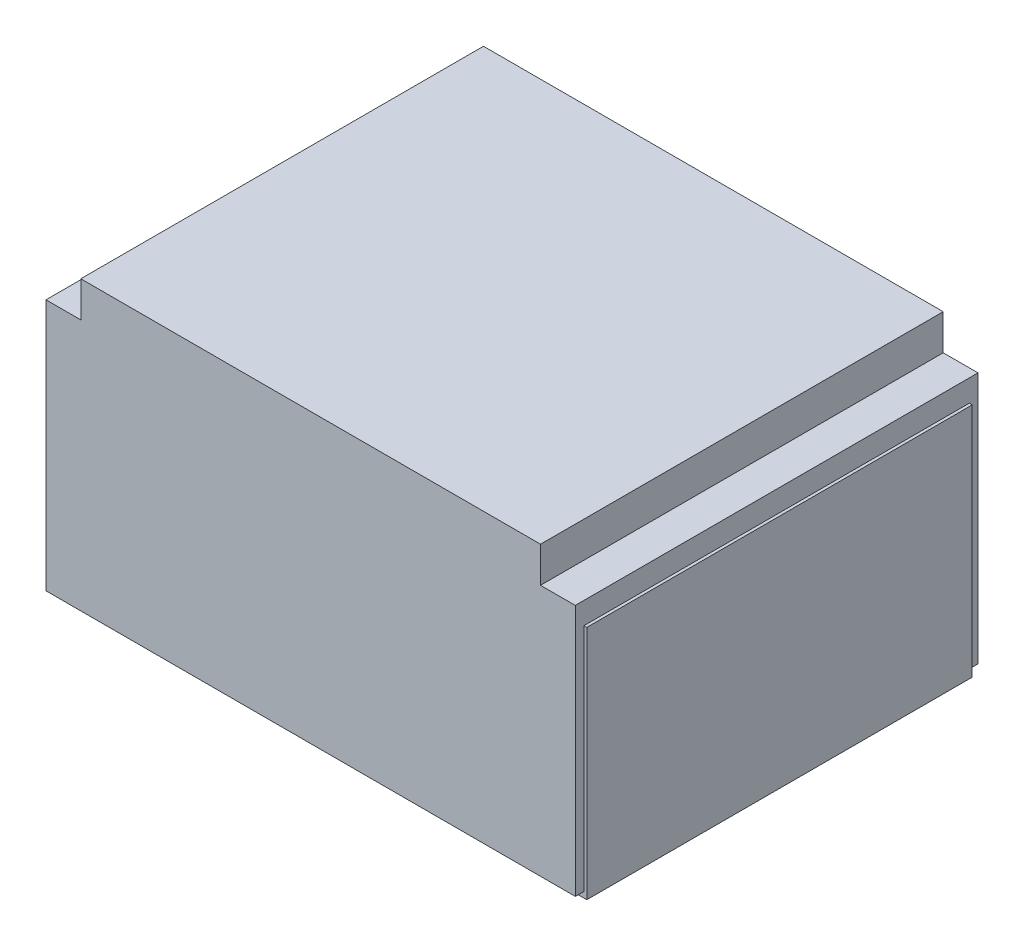
ISO-10303-21;
HEADER;
FILE_DESCRIPTION(('STEP AP214'),'2;1');
FILE_NAME('part.step','',(''),(''),'','','');
FILE_SCHEMA(('AUTOMOTIVE_DESIGN { 1 0 10303 214 1 1 1 1 }'));
ENDSEC;
DATA;
#1=APPLICATION_CONTEXT('core data for automotive mechanical design processes');
#2=APPLICATION_PROTOCOL_DEFINITION('international standard','automotive_design',2000,#1);
#3=PRODUCT_CONTEXT('',#1,'mechanical');
#4=PRODUCT('Part','Part','',(#3));
#5=PRODUCT_RELATED_PRODUCT_CATEGORY('part','',(#4));
#6=PRODUCT_DEFINITION_FORMATION('','',#4);
#7=PRODUCT_DEFINITION_CONTEXT('part definition',#1,'design');
#8=PRODUCT_DEFINITION('design','',#6,#7);
#9=PRODUCT_DEFINITION_SHAPE('','',#8);
#10=(LENGTH_UNIT() NAMED_UNIT(*) SI_UNIT(.MILLI.,.METRE.));
#11=(NAMED_UNIT(*) PLANE_ANGLE_UNIT() SI_UNIT($,.RADIAN.));
#12=(NAMED_UNIT(*) SI_UNIT($,.STERADIAN.) SOLID_ANGLE_UNIT());
#13=UNCERTAINTY_MEASURE_WITH_UNIT(LENGTH_MEASURE(1.E-05),#10,'distance_accuracy_value','');
#14=(GEOMETRIC_REPRESENTATION_CONTEXT(3) GLOBAL_UNCERTAINTY_ASSIGNED_CONTEXT((#13)) GLOBAL_UNIT_ASSIGNED_CONTEXT((#10,
#11,#12)) REPRESENTATION_CONTEXT('',''));
#15=CARTESIAN_POINT('',(0.,0.,0.));
#16=DIRECTION('',(0.,0.,1.));
#17=DIRECTION('',(1.,0.,0.));
#18=AXIS2_PLACEMENT_3D('',#15,#16,#17);
#19=CARTESIAN_POINT('',(0.,-1.65,1.59590093004976));
#20=DIRECTION('',(0.,1.,0.));
#21=DIRECTION('',(-1.,0.,0.));
#22=AXIS2_PLACEMENT_3D('',#19,#20,#21);
#23=CYLINDRICAL_SURFACE('',#22,1.);
#24=CARTESIAN_POINT('',(0.,-1.6,1.59590093004976));
#25=DIRECTION('',(0.,-1.,0.));
#26=DIRECTION('',(1.,0.,0.));
#27=AXIS2_PLACEMENT_3D('',#24,#25,#26);
#28=CIRCLE('',#27,1.);
#29=CARTESIAN_POINT('',(1.,-1.6,1.59590093004976));
#30=VERTEX_POINT('',#29);
#31=EDGE_CURVE('E11',#30,#30,#28,.F.);
#32=ORIENTED_EDGE('',*,*,#31,.T.);
#33=EDGE_LOOP('',(#32));
#34=FACE_BOUND('',#33,.T.);
#35=CARTESIAN_POINT('',(0.,-1.25,1.59590093004976));
#36=DIRECTION('',(0.,-1.,0.));
#37=DIRECTION('',(1.,0.,0.));
#38=AXIS2_PLACEMENT_3D('',#35,#36,#37);
#39=CIRCLE('',#38,1.);
#40=CARTESIAN_POINT('',(1.,-1.25,1.59590093004976));
#41=VERTEX_POINT('',#40);
#42=EDGE_CURVE('E63',#41,#41,#39,.T.);
#43=ORIENTED_EDGE('',*,*,#42,.T.);
#44=EDGE_LOOP('',(#43));
#45=FACE_BOUND('',#44,.T.);
#46=ADVANCED_FACE('F52',(#34,#45),#23,.T.);
#47=CARTESIAN_POINT('',(0.,-1.65,1.59590093004976));
#48=DIRECTION('',(0.,-1.,0.));
#49=DIRECTION('',(1.,0.,0.));
#50=AXIS2_PLACEMENT_3D('',#47,#48,#49);
#51=PLANE('',#50);
#52=CARTESIAN_POINT('',(0.,-1.65,1.59590093004976));
#53=DIRECTION('',(0.,-1.,0.));
#54=DIRECTION('',(1.,0.,0.));
#55=AXIS2_PLACEMENT_3D('',#52,#53,#54);
#56=CIRCLE('',#55,0.95);
#57=CARTESIAN_POINT('',(0.950000000000001,-1.65,1.59590093004976));
#58=VERTEX_POINT('',#57);
#59=EDGE_CURVE('E59',#58,#58,#56,.T.);
#60=ORIENTED_EDGE('',*,*,#59,.T.);
#61=EDGE_LOOP('',(#60));
#62=FACE_BOUND('',#61,.T.);
#63=ADVANCED_FACE('F73',(#62),#51,.T.);
#64=CARTESIAN_POINT('',(0.,-1.25,1.59590093004976));
#65=DIRECTION('',(0.,-1.,0.));
#66=DIRECTION('',(1.,0.,0.));
#67=AXIS2_PLACEMENT_3D('',#64,#65,#66);
#68=PLANE('',#67);
#69=ORIENTED_EDGE('',*,*,#42,.F.);
#70=EDGE_LOOP('',(#69));
#71=FACE_BOUND('',#70,.T.);
#72=ADVANCED_FACE('F71',(#71),#68,.F.);
#73=CARTESIAN_POINT('',(0.,-1.6,1.59590093004976));
#74=DIRECTION('',(0.,-1.,0.));
#75=DIRECTION('',(1.,0.,0.));
#76=AXIS2_PLACEMENT_3D('',#73,#74,#75);
#77=TOROIDAL_SURFACE('',#76,0.95,0.05);
#78=ORIENTED_EDGE('',*,*,#31,.F.);
#79=EDGE_LOOP('',(#78));
#80=FACE_BOUND('',#79,.T.);
#81=ORIENTED_EDGE('',*,*,#59,.F.);
#82=EDGE_LOOP('',(#81));
#83=FACE_BOUND('',#82,.T.);
#84=ADVANCED_FACE('F54',(#80,#83),#77,.T.);
#85=CLOSED_SHELL('',(#46,#63,#72,#84));
#86=MANIFOLD_SOLID_BREP('B2',#85);
#87=CARTESIAN_POINT('',(0.,-1.25,0.));
#88=DIRECTION('',(0.,1.,0.));
#89=DIRECTION('',(-1.,0.,0.));
#90=AXIS2_PLACEMENT_3D('',#87,#88,#89);
#91=PLANE('',#90);
#92=CARTESIAN_POINT('',(-1.92312305951284,-1.25,3.08939493928833));
#93=DIRECTION('',(0.,-1.,0.));
#94=DIRECTION('',(1.,0.,0.));
#95=AXIS2_PLACEMENT_3D('',#92,#93,#94);
#96=CIRCLE('',#95,0.162382368531784);
#97=CARTESIAN_POINT('',(-1.76074069098106,-1.25,3.08939493928833));
#98=VERTEX_POINT('',#97);
#99=EDGE_CURVE('E257',#98,#98,#96,.T.);
#100=ORIENTED_EDGE('',*,*,#99,.T.);
#101=EDGE_LOOP('',(#100));
#102=FACE_BOUND('',#101,.T.);
#103=CARTESIAN_POINT('',(0.,-1.25,1.59590093004976));
#104=DIRECTION('',(0.,-1.,0.));
#105=DIRECTION('',(1.,0.,0.));
#106=AXIS2_PLACEMENT_3D('',#103,#104,#105);
#107=CIRCLE('',#106,1.05);
#108=CARTESIAN_POINT('',(1.05,-1.25,1.59590093004976));
#109=VERTEX_POINT('',#108);
#110=EDGE_CURVE('E297',#109,#109,#107,.T.);
#111=ORIENTED_EDGE('',*,*,#110,.T.);
#112=EDGE_LOOP('',(#111));
#113=FACE_BOUND('',#112,.T.);
#114=CARTESIAN_POINT('',(1.92312305951285,-1.25,3.08939493928832));
#115=DIRECTION('',(0.,-1.,0.));
#116=DIRECTION('',(-1.,0.,0.));
#117=AXIS2_PLACEMENT_3D('',#114,#115,#116);
#118=CIRCLE('',#117,0.162382368531784);
#119=CARTESIAN_POINT('',(1.76074069098106,-1.25,3.08939493928832));
#120=VERTEX_POINT('',#119);
#121=EDGE_CURVE('E312',#120,#120,#118,.T.);
#122=ORIENTED_EDGE('',*,*,#121,.T.);
#123=EDGE_LOOP('',(#122));
#124=FACE_BOUND('',#123,.T.);
#125=DIRECTION('',(-1.,0.,0.));
#126=VECTOR('',#125,1.);
#127=CARTESIAN_POINT('',(-2.325,-1.25,3.425));
#128=LINE('',#127,#126);
#129=CARTESIAN_POINT('',(2.3,-1.25,3.425));
#130=VERTEX_POINT('',#129);
#131=CARTESIAN_POINT('',(-2.3,-1.25,3.425));
#132=VERTEX_POINT('',#131);
#133=EDGE_CURVE('E132',#130,#132,#128,.T.);
#134=ORIENTED_EDGE('',*,*,#133,.F.);
#135=DIRECTION('',(0.,0.,1.));
#136=VECTOR('',#135,1.);
#137=CARTESIAN_POINT('',(2.3,-1.25,3.425));
#138=LINE('',#137,#136);
#139=CARTESIAN_POINT('',(2.3,-1.25,0.0750000000000017));
#140=VERTEX_POINT('',#139);
#141=EDGE_CURVE('E235',#140,#130,#138,.T.);
#142=ORIENTED_EDGE('',*,*,#141,.F.);
#143=DIRECTION('',(1.,0.,0.));
#144=VECTOR('',#143,1.);
#145=CARTESIAN_POINT('',(-2.325,-1.25,0.075));
#146=LINE('',#145,#144);
#147=CARTESIAN_POINT('',(1.74824973955554,-1.25,0.0750000000000008));
#148=VERTEX_POINT('',#147);
#149=EDGE_CURVE('E247',#148,#140,#146,.T.);
#150=ORIENTED_EDGE('',*,*,#149,.F.);
#151=DIRECTION('',(0.,0.,1.));
#152=VECTOR('',#151,1.);
#153=CARTESIAN_POINT('',(1.74824973955554,-1.25,0.0750000000000008));
#154=LINE('',#153,#152);
#155=CARTESIAN_POINT('',(1.74824973955554,-1.25,0.44131323707769));
#156=VERTEX_POINT('',#155);
#157=EDGE_CURVE('E335',#148,#156,#154,.T.);
#158=ORIENTED_EDGE('',*,*,#157,.T.);
#159=DIRECTION('',(-1.,0.,0.));
#160=VECTOR('',#159,1.);
#161=CARTESIAN_POINT('',(1.74824973955554,-1.25,0.44131323707769));
#162=LINE('',#161,#160);
#163=CARTESIAN_POINT('',(1.64832212815136,-1.25,0.44131323707769));
#164=VERTEX_POINT('',#163);
#165=EDGE_CURVE('E140',#156,#164,#162,.T.);
#166=ORIENTED_EDGE('',*,*,#165,.T.);
#167=DIRECTION('',(-0.57346234436333,0.,-0.81923192051904));
#168=VECTOR('',#167,1.);
#169=CARTESIAN_POINT('',(1.64832212815136,-1.25,0.44131323707769));
#170=LINE('',#169,#168);
#171=CARTESIAN_POINT('',(1.47344880819406,-1.25,0.191494208567253));
#172=VERTEX_POINT('',#171);
#173=EDGE_CURVE('E363',#164,#172,#170,.T.);
#174=ORIENTED_EDGE('',*,*,#173,.T.);
#175=DIRECTION('',(-1.,0.,0.));
#176=VECTOR('',#175,1.);
#177=CARTESIAN_POINT('',(-1.47344880819406,-1.25,0.191494208567252));
#178=LINE('',#177,#176);
#179=CARTESIAN_POINT('',(-1.47344880819406,-1.25,0.191494208567252));
#180=VERTEX_POINT('',#179);
#181=EDGE_CURVE('E360',#172,#180,#178,.T.);
#182=ORIENTED_EDGE('',*,*,#181,.T.);
#183=DIRECTION('',(-0.573462344363329,0.,0.81923192051904));
#184=VECTOR('',#183,1.);
#185=CARTESIAN_POINT('',(-1.64832212815136,-1.25,0.441313237077689));
#186=LINE('',#185,#184);
#187=CARTESIAN_POINT('',(-1.64832212815136,-1.25,0.441313237077689));
#188=VERTEX_POINT('',#187);
#189=EDGE_CURVE('E357',#180,#188,#186,.T.);
#190=ORIENTED_EDGE('',*,*,#189,.T.);
#191=DIRECTION('',(-1.,0.,0.));
#192=VECTOR('',#191,1.);
#193=CARTESIAN_POINT('',(-1.74824973955554,-1.25,0.441313237077689));
#194=LINE('',#193,#192);
#195=CARTESIAN_POINT('',(-1.74824973955554,-1.25,0.441313237077689));
#196=VERTEX_POINT('',#195);
#197=EDGE_CURVE('E354',#188,#196,#194,.T.);
#198=ORIENTED_EDGE('',*,*,#197,.T.);
#199=DIRECTION('',(0.,0.,-1.));
#200=VECTOR('',#199,1.);
#201=CARTESIAN_POINT('',(-1.74824973955554,-1.25,0.075));
#202=LINE('',#201,#200);
#203=CARTESIAN_POINT('',(-1.74824973955554,-1.25,0.075));
#204=VERTEX_POINT('',#203);
#205=EDGE_CURVE('E317',#196,#204,#202,.T.);
#206=ORIENTED_EDGE('',*,*,#205,.T.);
#207=CARTESIAN_POINT('',(-2.3,-1.25,0.075));
#208=VERTEX_POINT('',#207);
#209=EDGE_CURVE('E254',#208,#204,#146,.T.);
#210=ORIENTED_EDGE('',*,*,#209,.F.);
#211=DIRECTION('',(0.,0.,-1.));
#212=VECTOR('',#211,1.);
#213=CARTESIAN_POINT('',(-2.3,-1.25,3.425));
#214=LINE('',#213,#212);
#215=EDGE_CURVE('E248',#132,#208,#214,.T.);
#216=ORIENTED_EDGE('',*,*,#215,.F.);
#217=EDGE_LOOP('',(#134,#142,#150,#158,#166,#174,#182,#190,#198,#206,#210,#216));
#218=FACE_BOUND('',#217,.T.);
#219=ADVANCED_FACE('F117',(#102,#113,#124,#218),#91,.T.);
#220=CARTESIAN_POINT('',(-2.325,-1.3,0.075));
#221=DIRECTION('',(0.,0.,1.));
#222=DIRECTION('',(1.,0.,0.));
#223=AXIS2_PLACEMENT_3D('',#220,#221,#222);
#224=PLANE('',#223);
#225=DIRECTION('',(0.,1.,0.));
#226=VECTOR('',#225,1.);
#227=CARTESIAN_POINT('',(-2.325,-1.3,0.075));
#228=LINE('',#227,#226);
#229=CARTESIAN_POINT('',(-2.325,-1.3,0.075));
#230=VERTEX_POINT('',#229);
#231=CARTESIAN_POINT('',(-2.325,0.75,0.075));
#232=VERTEX_POINT('',#231);
#233=EDGE_CURVE('E263',#230,#232,#228,.T.);
#234=ORIENTED_EDGE('',*,*,#233,.T.);
#235=DIRECTION('',(-1.,0.,0.));
#236=VECTOR('',#235,1.);
#237=CARTESIAN_POINT('',(-2.3,0.75,0.075));
#238=LINE('',#237,#236);
#239=CARTESIAN_POINT('',(-2.3,0.75,0.075));
#240=VERTEX_POINT('',#239);
#241=EDGE_CURVE('E280',#240,#232,#238,.T.);
#242=ORIENTED_EDGE('',*,*,#241,.F.);
#243=DIRECTION('',(0.,-1.,0.));
#244=VECTOR('',#243,1.);
#245=CARTESIAN_POINT('',(-2.3,0.75,0.075));
#246=LINE('',#245,#244);
#247=EDGE_CURVE('E288',#240,#208,#246,.T.);
#248=ORIENTED_EDGE('',*,*,#247,.T.);
#249=ORIENTED_EDGE('',*,*,#209,.T.);
#250=DIRECTION('',(0.,-1.,0.));
#251=VECTOR('',#250,1.);
#252=CARTESIAN_POINT('',(-1.74824973955554,-1.25,0.075));
#253=LINE('',#252,#251);
#254=CARTESIAN_POINT('',(-1.74824973955554,-1.3,0.075));
#255=VERTEX_POINT('',#254);
#256=EDGE_CURVE('E307',#204,#255,#253,.T.);
#257=ORIENTED_EDGE('',*,*,#256,.T.);
#258=DIRECTION('',(1.,0.,0.));
#259=VECTOR('',#258,1.);
#260=CARTESIAN_POINT('',(-2.325,-1.3,0.075));
#261=LINE('',#260,#259);
#262=EDGE_CURVE('E264',#230,#255,#261,.T.);
#263=ORIENTED_EDGE('',*,*,#262,.F.);
#264=EDGE_LOOP('',(#234,#242,#248,#249,#257,#263));
#265=FACE_BOUND('',#264,.T.);
#266=ADVANCED_FACE('F404',(#265),#224,.F.);
#267=CARTESIAN_POINT('',(2.325,-1.3,0.075));
#268=DIRECTION('',(-1.,0.,0.));
#269=DIRECTION('',(0.,-1.,0.));
#270=AXIS2_PLACEMENT_3D('',#267,#268,#269);
#271=PLANE('',#270);
#272=DIRECTION('',(0.,1.,0.));
#273=VECTOR('',#272,1.);
#274=CARTESIAN_POINT('',(2.325,-1.3,0.075));
#275=LINE('',#274,#273);
#276=CARTESIAN_POINT('',(2.325,-1.3,0.075));
#277=VERTEX_POINT('',#276);
#278=CARTESIAN_POINT('',(2.325,0.75,0.0750000000000017));
#279=VERTEX_POINT('',#278);
#280=EDGE_CURVE('E261',#277,#279,#275,.T.);
#281=ORIENTED_EDGE('',*,*,#280,.T.);
#282=DIRECTION('',(0.,0.,-1.));
#283=VECTOR('',#282,1.);
#284=CARTESIAN_POINT('',(2.325,0.75,0.0750000000000017));
#285=LINE('',#284,#283);
#286=CARTESIAN_POINT('',(2.325,0.75,3.425));
#287=VERTEX_POINT('',#286);
#288=EDGE_CURVE('E386',#287,#279,#285,.T.);
#289=ORIENTED_EDGE('',*,*,#288,.F.);
#290=DIRECTION('',(0.,1.,0.));
#291=VECTOR('',#290,1.);
#292=CARTESIAN_POINT('',(2.325,-1.3,3.425));
#293=LINE('',#292,#291);
#294=CARTESIAN_POINT('',(2.325,-1.3,3.425));
#295=VERTEX_POINT('',#294);
#296=EDGE_CURVE('E50',#295,#287,#293,.T.);
#297=ORIENTED_EDGE('',*,*,#296,.F.);
#298=DIRECTION('',(0.,0.,1.));
#299=VECTOR('',#298,1.);
#300=CARTESIAN_POINT('',(2.325,-1.3,0.075));
#301=LINE('',#300,#299);
#302=EDGE_CURVE('E256',#277,#295,#301,.T.);
#303=ORIENTED_EDGE('',*,*,#302,.F.);
#304=EDGE_LOOP('',(#281,#289,#297,#303));
#305=FACE_BOUND('',#304,.T.);
#306=ADVANCED_FACE('F119',(#305),#271,.F.);
#307=CARTESIAN_POINT('',(-2.325,-1.3,3.425));
#308=DIRECTION('',(0.,0.,-1.));
#309=DIRECTION('',(-1.,0.,0.));
#310=AXIS2_PLACEMENT_3D('',#307,#308,#309);
#311=PLANE('',#310);
#312=ORIENTED_EDGE('',*,*,#296,.T.);
#313=DIRECTION('',(1.,0.,0.));
#314=VECTOR('',#313,1.);
#315=CARTESIAN_POINT('',(2.325,0.75,3.425));
#316=LINE('',#315,#314);
#317=CARTESIAN_POINT('',(2.3,0.75,3.425));
#318=VERTEX_POINT('',#317);
#319=EDGE_CURVE('E388',#318,#287,#316,.T.);
#320=ORIENTED_EDGE('',*,*,#319,.F.);
#321=DIRECTION('',(0.,-1.,0.));
#322=VECTOR('',#321,1.);
#323=CARTESIAN_POINT('',(2.3,0.75,3.425));
#324=LINE('',#323,#322);
#325=EDGE_CURVE('E242',#318,#130,#324,.T.);
#326=ORIENTED_EDGE('',*,*,#325,.T.);
#327=ORIENTED_EDGE('',*,*,#133,.T.);
#328=DIRECTION('',(0.,-1.,0.));
#329=VECTOR('',#328,1.);
#330=CARTESIAN_POINT('',(-2.3,0.75,3.425));
#331=LINE('',#330,#329);
#332=CARTESIAN_POINT('',(-2.3,0.75,3.425));
#333=VERTEX_POINT('',#332);
#334=EDGE_CURVE('E284',#333,#132,#331,.T.);
#335=ORIENTED_EDGE('',*,*,#334,.F.);
#336=DIRECTION('',(1.,0.,0.));
#337=VECTOR('',#336,1.);
#338=CARTESIAN_POINT('',(-2.325,0.75,3.425));
#339=LINE('',#338,#337);
#340=CARTESIAN_POINT('',(-2.325,0.75,3.425));
#341=VERTEX_POINT('',#340);
#342=EDGE_CURVE('E278',#341,#333,#339,.T.);
#343=ORIENTED_EDGE('',*,*,#342,.F.);
#344=DIRECTION('',(0.,1.,0.));
#345=VECTOR('',#344,1.);
#346=CARTESIAN_POINT('',(-2.325,-1.3,3.425));
#347=LINE('',#346,#345);
#348=CARTESIAN_POINT('',(-2.325,-1.3,3.425));
#349=VERTEX_POINT('',#348);
#350=EDGE_CURVE('E125',#349,#341,#347,.T.);
#351=ORIENTED_EDGE('',*,*,#350,.F.);
#352=DIRECTION('',(-1.,0.,0.));
#353=VECTOR('',#352,1.);
#354=CARTESIAN_POINT('',(-2.325,-1.3,3.425));
#355=LINE('',#354,#353);
#356=EDGE_CURVE('E370',#295,#349,#355,.T.);
#357=ORIENTED_EDGE('',*,*,#356,.F.);
#358=EDGE_LOOP('',(#312,#320,#326,#327,#335,#343,#351,#357));
#359=FACE_BOUND('',#358,.T.);
#360=ADVANCED_FACE('F282',(#359),#311,.F.);
#361=CARTESIAN_POINT('',(-2.325,-1.3,0.075));
#362=DIRECTION('',(1.,0.,0.));
#363=DIRECTION('',(0.,1.,0.));
#364=AXIS2_PLACEMENT_3D('',#361,#362,#363);
#365=PLANE('',#364);
#366=ORIENTED_EDGE('',*,*,#350,.T.);
#367=DIRECTION('',(0.,0.,1.));
#368=VECTOR('',#367,1.);
#369=CARTESIAN_POINT('',(-2.325,0.75,0.075));
#370=LINE('',#369,#368);
#371=EDGE_CURVE('E272',#232,#341,#370,.T.);
#372=ORIENTED_EDGE('',*,*,#371,.F.);
#373=ORIENTED_EDGE('',*,*,#233,.F.);
#374=DIRECTION('',(0.,0.,-1.));
#375=VECTOR('',#374,1.);
#376=CARTESIAN_POINT('',(-2.325,-1.3,0.075));
#377=LINE('',#376,#375);
#378=EDGE_CURVE('E274',#349,#230,#377,.T.);
#379=ORIENTED_EDGE('',*,*,#378,.F.);
#380=EDGE_LOOP('',(#366,#372,#373,#379));
#381=FACE_BOUND('',#380,.T.);
#382=ADVANCED_FACE('F270',(#381),#365,.F.);
#383=CARTESIAN_POINT('',(1.74824973955554,-1.3,0.0750000000000008));
#384=VERTEX_POINT('',#383);
#385=EDGE_CURVE('E372',#384,#277,#261,.T.);
#386=ORIENTED_EDGE('',*,*,#385,.F.);
#387=DIRECTION('',(0.,-1.,0.));
#388=VECTOR('',#387,1.);
#389=CARTESIAN_POINT('',(1.74824973955554,-1.25,0.0750000000000008));
#390=LINE('',#389,#388);
#391=EDGE_CURVE('E253',#148,#384,#390,.T.);
#392=ORIENTED_EDGE('',*,*,#391,.F.);
#393=ORIENTED_EDGE('',*,*,#149,.T.);
#394=DIRECTION('',(0.,-1.,0.));
#395=VECTOR('',#394,1.);
#396=CARTESIAN_POINT('',(2.3,0.75,0.0750000000000017));
#397=LINE('',#396,#395);
#398=CARTESIAN_POINT('',(2.3,0.75,0.0750000000000017));
#399=VERTEX_POINT('',#398);
#400=EDGE_CURVE('E231',#399,#140,#397,.T.);
#401=ORIENTED_EDGE('',*,*,#400,.F.);
#402=DIRECTION('',(-1.,0.,0.));
#403=VECTOR('',#402,1.);
#404=CARTESIAN_POINT('',(2.3,0.75,0.0750000000000017));
#405=LINE('',#404,#403);
#406=EDGE_CURVE('E241',#279,#399,#405,.T.);
#407=ORIENTED_EDGE('',*,*,#406,.F.);
#408=ORIENTED_EDGE('',*,*,#280,.F.);
#409=EDGE_LOOP('',(#386,#392,#393,#401,#407,#408));
#410=FACE_BOUND('',#409,.T.);
#411=ADVANCED_FACE('F252',(#410),#224,.F.);
#412=CARTESIAN_POINT('',(0.,-1.3,0.));
#413=DIRECTION('',(0.,1.,0.));
#414=DIRECTION('',(-1.,0.,0.));
#415=AXIS2_PLACEMENT_3D('',#412,#413,#414);
#416=PLANE('',#415);
#417=CARTESIAN_POINT('',(-1.92312305951284,-1.3,3.08939493928833));
#418=DIRECTION('',(0.,-1.,0.));
#419=DIRECTION('',(1.,0.,0.));
#420=AXIS2_PLACEMENT_3D('',#417,#418,#419);
#421=CIRCLE('',#420,0.162382368531784);
#422=CARTESIAN_POINT('',(-1.76074069098106,-1.3,3.08939493928833));
#423=VERTEX_POINT('',#422);
#424=EDGE_CURVE('E300',#423,#423,#421,.T.);
#425=ORIENTED_EDGE('',*,*,#424,.F.);
#426=EDGE_LOOP('',(#425));
#427=FACE_BOUND('',#426,.T.);
#428=CARTESIAN_POINT('',(0.,-1.3,1.59590093004976));
#429=DIRECTION('',(0.,-1.,0.));
#430=DIRECTION('',(1.,0.,0.));
#431=AXIS2_PLACEMENT_3D('',#428,#429,#430);
#432=CIRCLE('',#431,1.05);
#433=CARTESIAN_POINT('',(1.05,-1.3,1.59590093004976));
#434=VERTEX_POINT('',#433);
#435=EDGE_CURVE('E304',#434,#434,#432,.T.);
#436=ORIENTED_EDGE('',*,*,#435,.F.);
#437=EDGE_LOOP('',(#436));
#438=FACE_BOUND('',#437,.T.);
#439=CARTESIAN_POINT('',(1.92312305951285,-1.3,3.08939493928832));
#440=DIRECTION('',(0.,-1.,0.));
#441=DIRECTION('',(-1.,0.,0.));
#442=AXIS2_PLACEMENT_3D('',#439,#440,#441);
#443=CIRCLE('',#442,0.162382368531784);
#444=CARTESIAN_POINT('',(1.76074069098106,-1.3,3.08939493928832));
#445=VERTEX_POINT('',#444);
#446=EDGE_CURVE('E303',#445,#445,#443,.T.);
#447=ORIENTED_EDGE('',*,*,#446,.F.);
#448=EDGE_LOOP('',(#447));
#449=FACE_BOUND('',#448,.T.);
#450=ORIENTED_EDGE('',*,*,#262,.T.);
#451=DIRECTION('',(0.,0.,-1.));
#452=VECTOR('',#451,1.);
#453=CARTESIAN_POINT('',(-1.74824973955554,-1.3,0.075));
#454=LINE('',#453,#452);
#455=CARTESIAN_POINT('',(-1.74824973955554,-1.3,0.441313237077689));
#456=VERTEX_POINT('',#455);
#457=EDGE_CURVE('E332',#456,#255,#454,.T.);
#458=ORIENTED_EDGE('',*,*,#457,.F.);
#459=DIRECTION('',(-1.,0.,0.));
#460=VECTOR('',#459,1.);
#461=CARTESIAN_POINT('',(-1.74824973955554,-1.3,0.441313237077689));
#462=LINE('',#461,#460);
#463=CARTESIAN_POINT('',(-1.64832212815136,-1.3,0.441313237077689));
#464=VERTEX_POINT('',#463);
#465=EDGE_CURVE('E334',#464,#456,#462,.T.);
#466=ORIENTED_EDGE('',*,*,#465,.F.);
#467=DIRECTION('',(-0.573462344363329,0.,0.81923192051904));
#468=VECTOR('',#467,1.);
#469=CARTESIAN_POINT('',(-1.64832212815136,-1.3,0.441313237077689));
#470=LINE('',#469,#468);
#471=CARTESIAN_POINT('',(-1.47344880819406,-1.3,0.191494208567252));
#472=VERTEX_POINT('',#471);
#473=EDGE_CURVE('E338',#472,#464,#470,.T.);
#474=ORIENTED_EDGE('',*,*,#473,.F.);
#475=DIRECTION('',(-1.,0.,0.));
#476=VECTOR('',#475,1.);
#477=CARTESIAN_POINT('',(-1.47344880819406,-1.3,0.191494208567252));
#478=LINE('',#477,#476);
#479=CARTESIAN_POINT('',(1.47344880819406,-1.3,0.191494208567253));
#480=VERTEX_POINT('',#479);
#481=EDGE_CURVE('E341',#480,#472,#478,.T.);
#482=ORIENTED_EDGE('',*,*,#481,.F.);
#483=DIRECTION('',(-0.57346234436333,0.,-0.81923192051904));
#484=VECTOR('',#483,1.);
#485=CARTESIAN_POINT('',(1.64832212815136,-1.3,0.44131323707769));
#486=LINE('',#485,#484);
#487=CARTESIAN_POINT('',(1.64832212815136,-1.3,0.44131323707769));
#488=VERTEX_POINT('',#487);
#489=EDGE_CURVE('E344',#488,#480,#486,.T.);
#490=ORIENTED_EDGE('',*,*,#489,.F.);
#491=DIRECTION('',(-1.,0.,0.));
#492=VECTOR('',#491,1.);
#493=CARTESIAN_POINT('',(1.74824973955554,-1.3,0.44131323707769));
#494=LINE('',#493,#492);
#495=CARTESIAN_POINT('',(1.74824973955554,-1.3,0.44131323707769));
#496=VERTEX_POINT('',#495);
#497=EDGE_CURVE('E347',#496,#488,#494,.T.);
#498=ORIENTED_EDGE('',*,*,#497,.F.);
#499=DIRECTION('',(0.,0.,1.));
#500=VECTOR('',#499,1.);
#501=CARTESIAN_POINT('',(1.74824973955554,-1.3,0.0750000000000008));
#502=LINE('',#501,#500);
#503=EDGE_CURVE('E315',#384,#496,#502,.T.);
#504=ORIENTED_EDGE('',*,*,#503,.F.);
#505=ORIENTED_EDGE('',*,*,#385,.T.);
#506=ORIENTED_EDGE('',*,*,#302,.T.);
#507=ORIENTED_EDGE('',*,*,#356,.T.);
#508=ORIENTED_EDGE('',*,*,#378,.T.);
#509=EDGE_LOOP('',(#450,#458,#466,#474,#482,#490,#498,#504,#505,#506,#507,#508));
#510=FACE_BOUND('',#509,.T.);
#511=ADVANCED_FACE('F379',(#427,#438,#449,#510),#416,.F.);
#512=CARTESIAN_POINT('',(1.92312305951285,-1.25,3.08939493928832));
#513=DIRECTION('',(0.,-1.,0.));
#514=DIRECTION('',(1.,0.,0.));
#515=AXIS2_PLACEMENT_3D('',#512,#513,#514);
#516=CYLINDRICAL_SURFACE('',#515,0.162382368531784);
#517=ORIENTED_EDGE('',*,*,#121,.F.);
#518=EDGE_LOOP('',(#517));
#519=FACE_BOUND('',#518,.T.);
#520=ORIENTED_EDGE('',*,*,#446,.T.);
#521=EDGE_LOOP('',(#520));
#522=FACE_BOUND('',#521,.T.);
#523=ADVANCED_FACE('F529',(#519,#522),#516,.F.);
#524=CARTESIAN_POINT('',(-1.74824973955554,-1.25,0.075));
#525=DIRECTION('',(-1.,0.,0.));
#526=DIRECTION('',(0.,-1.,0.));
#527=AXIS2_PLACEMENT_3D('',#524,#525,#526);
#528=PLANE('',#527);
#529=ORIENTED_EDGE('',*,*,#457,.T.);
#530=ORIENTED_EDGE('',*,*,#256,.F.);
#531=ORIENTED_EDGE('',*,*,#205,.F.);
#532=DIRECTION('',(0.,-1.,0.));
#533=VECTOR('',#532,1.);
#534=CARTESIAN_POINT('',(-1.74824973955554,-1.25,0.441313237077689));
#535=LINE('',#534,#533);
#536=EDGE_CURVE('E328',#196,#456,#535,.T.);
#537=ORIENTED_EDGE('',*,*,#536,.T.);
#538=EDGE_LOOP('',(#529,#530,#531,#537));
#539=FACE_BOUND('',#538,.T.);
#540=ADVANCED_FACE('F519',(#539),#528,.F.);
#541=CARTESIAN_POINT('',(-1.74824973955554,-1.25,0.441313237077689));
#542=DIRECTION('',(0.,0.,1.));
#543=DIRECTION('',(1.,0.,0.));
#544=AXIS2_PLACEMENT_3D('',#541,#542,#543);
#545=PLANE('',#544);
#546=ORIENTED_EDGE('',*,*,#465,.T.);
#547=ORIENTED_EDGE('',*,*,#536,.F.);
#548=ORIENTED_EDGE('',*,*,#197,.F.);
#549=DIRECTION('',(0.,-1.,0.));
#550=VECTOR('',#549,1.);
#551=CARTESIAN_POINT('',(-1.64832212815136,-1.25,0.441313237077689));
#552=LINE('',#551,#550);
#553=EDGE_CURVE('E326',#188,#464,#552,.T.);
#554=ORIENTED_EDGE('',*,*,#553,.T.);
#555=EDGE_LOOP('',(#546,#547,#548,#554));
#556=FACE_BOUND('',#555,.T.);
#557=ADVANCED_FACE('F509',(#556),#545,.F.);
#558=CARTESIAN_POINT('',(-1.64832212815136,-1.25,0.441313237077689));
#559=DIRECTION('',(0.81923192051904,0.,0.573462344363329));
#560=DIRECTION('',(0.573462344363329,0.,-0.81923192051904));
#561=AXIS2_PLACEMENT_3D('',#558,#559,#560);
#562=PLANE('',#561);
#563=ORIENTED_EDGE('',*,*,#473,.T.);
#564=ORIENTED_EDGE('',*,*,#553,.F.);
#565=ORIENTED_EDGE('',*,*,#189,.F.);
#566=DIRECTION('',(0.,-1.,0.));
#567=VECTOR('',#566,1.);
#568=CARTESIAN_POINT('',(-1.47344880819406,-1.25,0.191494208567252));
#569=LINE('',#568,#567);
#570=EDGE_CURVE('E324',#180,#472,#569,.T.);
#571=ORIENTED_EDGE('',*,*,#570,.T.);
#572=EDGE_LOOP('',(#563,#564,#565,#571));
#573=FACE_BOUND('',#572,.T.);
#574=ADVANCED_FACE('F499',(#573),#562,.F.);
#575=CARTESIAN_POINT('',(-1.47344880819406,-1.25,0.191494208567252));
#576=DIRECTION('',(0.,0.,1.));
#577=DIRECTION('',(1.,0.,0.));
#578=AXIS2_PLACEMENT_3D('',#575,#576,#577);
#579=PLANE('',#578);
#580=ORIENTED_EDGE('',*,*,#481,.T.);
#581=ORIENTED_EDGE('',*,*,#570,.F.);
#582=ORIENTED_EDGE('',*,*,#181,.F.);
#583=DIRECTION('',(0.,-1.,0.));
#584=VECTOR('',#583,1.);
#585=CARTESIAN_POINT('',(1.47344880819406,-1.25,0.191494208567253));
#586=LINE('',#585,#584);
#587=EDGE_CURVE('E322',#172,#480,#586,.T.);
#588=ORIENTED_EDGE('',*,*,#587,.T.);
#589=EDGE_LOOP('',(#580,#581,#582,#588));
#590=FACE_BOUND('',#589,.T.);
#591=ADVANCED_FACE('F489',(#590),#579,.F.);
#592=CARTESIAN_POINT('',(1.64832212815136,-1.25,0.44131323707769));
#593=DIRECTION('',(-0.81923192051904,0.,0.57346234436333));
#594=DIRECTION('',(0.57346234436333,0.,0.81923192051904));
#595=AXIS2_PLACEMENT_3D('',#592,#593,#594);
#596=PLANE('',#595);
#597=ORIENTED_EDGE('',*,*,#489,.T.);
#598=ORIENTED_EDGE('',*,*,#587,.F.);
#599=ORIENTED_EDGE('',*,*,#173,.F.);
#600=DIRECTION('',(0.,-1.,0.));
#601=VECTOR('',#600,1.);
#602=CARTESIAN_POINT('',(1.64832212815136,-1.25,0.44131323707769));
#603=LINE('',#602,#601);
#604=EDGE_CURVE('E320',#164,#488,#603,.T.);
#605=ORIENTED_EDGE('',*,*,#604,.T.);
#606=EDGE_LOOP('',(#597,#598,#599,#605));
#607=FACE_BOUND('',#606,.T.);
#608=ADVANCED_FACE('F480',(#607),#596,.F.);
#609=CARTESIAN_POINT('',(1.74824973955554,-1.25,0.44131323707769));
#610=DIRECTION('',(0.,0.,1.));
#611=DIRECTION('',(1.,0.,0.));
#612=AXIS2_PLACEMENT_3D('',#609,#610,#611);
#613=PLANE('',#612);
#614=ORIENTED_EDGE('',*,*,#497,.T.);
#615=ORIENTED_EDGE('',*,*,#604,.F.);
#616=ORIENTED_EDGE('',*,*,#165,.F.);
#617=DIRECTION('',(0.,-1.,0.));
#618=VECTOR('',#617,1.);
#619=CARTESIAN_POINT('',(1.74824973955554,-1.25,0.44131323707769));
#620=LINE('',#619,#618);
#621=EDGE_CURVE('E318',#156,#496,#620,.T.);
#622=ORIENTED_EDGE('',*,*,#621,.T.);
#623=EDGE_LOOP('',(#614,#615,#616,#622));
#624=FACE_BOUND('',#623,.T.);
#625=ADVANCED_FACE('F470',(#624),#613,.F.);
#626=CARTESIAN_POINT('',(1.74824973955554,-1.25,0.0750000000000008));
#627=DIRECTION('',(1.,0.,0.));
#628=DIRECTION('',(0.,0.,-1.));
#629=AXIS2_PLACEMENT_3D('',#626,#627,#628);
#630=PLANE('',#629);
#631=ORIENTED_EDGE('',*,*,#503,.T.);
#632=ORIENTED_EDGE('',*,*,#621,.F.);
#633=ORIENTED_EDGE('',*,*,#157,.F.);
#634=ORIENTED_EDGE('',*,*,#391,.T.);
#635=EDGE_LOOP('',(#631,#632,#633,#634));
#636=FACE_BOUND('',#635,.T.);
#637=ADVANCED_FACE('F460',(#636),#630,.F.);
#638=CARTESIAN_POINT('',(0.,-1.25,1.59590093004976));
#639=DIRECTION('',(0.,-1.,0.));
#640=DIRECTION('',(1.,0.,0.));
#641=AXIS2_PLACEMENT_3D('',#638,#639,#640);
#642=CYLINDRICAL_SURFACE('',#641,1.05);
#643=ORIENTED_EDGE('',*,*,#110,.F.);
#644=EDGE_LOOP('',(#643));
#645=FACE_BOUND('',#644,.T.);
#646=ORIENTED_EDGE('',*,*,#435,.T.);
#647=EDGE_LOOP('',(#646));
#648=FACE_BOUND('',#647,.T.);
#649=ADVANCED_FACE('F450',(#645,#648),#642,.F.);
#650=CARTESIAN_POINT('',(-1.92312305951284,-1.25,3.08939493928833));
#651=DIRECTION('',(0.,-1.,0.));
#652=DIRECTION('',(1.,0.,0.));
#653=AXIS2_PLACEMENT_3D('',#650,#651,#652);
#654=CYLINDRICAL_SURFACE('',#653,0.162382368531784);
#655=ORIENTED_EDGE('',*,*,#99,.F.);
#656=EDGE_LOOP('',(#655));
#657=FACE_BOUND('',#656,.T.);
#658=ORIENTED_EDGE('',*,*,#424,.T.);
#659=EDGE_LOOP('',(#658));
#660=FACE_BOUND('',#659,.T.);
#661=ADVANCED_FACE('F445',(#657,#660),#654,.F.);
#662=CARTESIAN_POINT('',(-2.3,0.75,3.425));
#663=DIRECTION('',(-1.,0.,0.));
#664=DIRECTION('',(0.,-1.,0.));
#665=AXIS2_PLACEMENT_3D('',#662,#663,#664);
#666=PLANE('',#665);
#667=ORIENTED_EDGE('',*,*,#215,.T.);
#668=ORIENTED_EDGE('',*,*,#247,.F.);
#669=DIRECTION('',(0.,0.,-1.));
#670=VECTOR('',#669,1.);
#671=CARTESIAN_POINT('',(-2.3,0.75,3.425));
#672=LINE('',#671,#670);
#673=EDGE_CURVE('E286',#333,#240,#672,.T.);
#674=ORIENTED_EDGE('',*,*,#673,.F.);
#675=ORIENTED_EDGE('',*,*,#334,.T.);
#676=EDGE_LOOP('',(#667,#668,#674,#675));
#677=FACE_BOUND('',#676,.T.);
#678=ADVANCED_FACE('F449',(#677),#666,.F.);
#679=CARTESIAN_POINT('',(0.,0.75,0.));
#680=DIRECTION('',(0.,1.,0.));
#681=DIRECTION('',(0.,0.,1.));
#682=AXIS2_PLACEMENT_3D('',#679,#680,#681);
#683=PLANE('',#682);
#684=ORIENTED_EDGE('',*,*,#241,.T.);
#685=ORIENTED_EDGE('',*,*,#371,.T.);
#686=ORIENTED_EDGE('',*,*,#342,.T.);
#687=ORIENTED_EDGE('',*,*,#673,.T.);
#688=EDGE_LOOP('',(#684,#685,#686,#687));
#689=FACE_BOUND('',#688,.T.);
#690=ADVANCED_FACE('F277',(#689),#683,.T.);
#691=CARTESIAN_POINT('',(2.3,0.75,3.425));
#692=DIRECTION('',(1.,0.,0.));
#693=DIRECTION('',(0.,1.,0.));
#694=AXIS2_PLACEMENT_3D('',#691,#692,#693);
#695=PLANE('',#694);
#696=ORIENTED_EDGE('',*,*,#141,.T.);
#697=ORIENTED_EDGE('',*,*,#325,.F.);
#698=DIRECTION('',(0.,0.,1.));
#699=VECTOR('',#698,1.);
#700=CARTESIAN_POINT('',(2.3,0.75,3.425));
#701=LINE('',#700,#699);
#702=EDGE_CURVE('E237',#399,#318,#701,.T.);
#703=ORIENTED_EDGE('',*,*,#702,.F.);
#704=ORIENTED_EDGE('',*,*,#400,.T.);
#705=EDGE_LOOP('',(#696,#697,#703,#704));
#706=FACE_BOUND('',#705,.T.);
#707=ADVANCED_FACE('F233',(#706),#695,.F.);
#708=CARTESIAN_POINT('',(0.,0.75,0.));
#709=DIRECTION('',(0.,-1.,0.));
#710=DIRECTION('',(0.,0.,-1.));
#711=AXIS2_PLACEMENT_3D('',#708,#709,#710);
#712=PLANE('',#711);
#713=ORIENTED_EDGE('',*,*,#702,.T.);
#714=ORIENTED_EDGE('',*,*,#319,.T.);
#715=ORIENTED_EDGE('',*,*,#288,.T.);
#716=ORIENTED_EDGE('',*,*,#406,.T.);
#717=EDGE_LOOP('',(#713,#714,#715,#716));
#718=FACE_BOUND('',#717,.T.);
#719=ADVANCED_FACE('F390',(#718),#712,.F.);
#720=CLOSED_SHELL('',(#219,#266,#306,#360,#382,#411,#511,#523,#540,#557,#574,#591,#608,#625,
#637,#649,#661,#678,#690,#707,#719));
#721=MANIFOLD_SOLID_BREP('B6',#720);
#722=CARTESIAN_POINT('',(-2.3,1.25,3.5));
#723=DIRECTION('',(1.,0.,0.));
#724=DIRECTION('',(0.,1.,0.));
#725=AXIS2_PLACEMENT_3D('',#722,#723,#724);
#726=PLANE('',#725);
#727=DIRECTION('',(0.,-1.,0.));
#728=VECTOR('',#727,1.);
#729=CARTESIAN_POINT('',(-2.3,1.25,3.5));
#730=LINE('',#729,#728);
#731=CARTESIAN_POINT('',(-2.3,0.940583691680877,3.5));
#732=VERTEX_POINT('',#731);
#733=CARTESIAN_POINT('',(-2.3,-1.25,3.5));
#734=VERTEX_POINT('',#733);
#735=EDGE_CURVE('E711',#732,#734,#730,.T.);
#736=ORIENTED_EDGE('',*,*,#735,.F.);
#737=DIRECTION('',(0.,0.,1.));
#738=VECTOR('',#737,1.);
#739=CARTESIAN_POINT('',(-2.3,0.940583691680877,0.));
#740=LINE('',#739,#738);
#741=CARTESIAN_POINT('',(-2.3,0.940583691680877,0.));
#742=VERTEX_POINT('',#741);
#743=EDGE_CURVE('E699',#742,#732,#740,.T.);
#744=ORIENTED_EDGE('',*,*,#743,.F.);
#745=DIRECTION('',(0.,-1.,0.));
#746=VECTOR('',#745,1.);
#747=CARTESIAN_POINT('',(-2.3,1.25,0.));
#748=LINE('',#747,#746);
#749=CARTESIAN_POINT('',(-2.3,-1.25,0.));
#750=VERTEX_POINT('',#749);
#751=EDGE_CURVE('E709',#742,#750,#748,.T.);
#752=ORIENTED_EDGE('',*,*,#751,.T.);
#753=DIRECTION('',(0.,0.,-1.));
#754=VECTOR('',#753,1.);
#755=CARTESIAN_POINT('',(-2.3,-1.25,3.5));
#756=LINE('',#755,#754);
#757=EDGE_CURVE('E115',#734,#750,#756,.T.);
#758=ORIENTED_EDGE('',*,*,#757,.F.);
#759=EDGE_LOOP('',(#736,#744,#752,#758));
#760=FACE_BOUND('',#759,.T.);
#761=ADVANCED_FACE('F631',(#760),#726,.F.);
#762=CARTESIAN_POINT('',(2.3,-1.25,3.5));
#763=DIRECTION('',(0.,1.,0.));
#764=DIRECTION('',(-1.,0.,0.));
#765=AXIS2_PLACEMENT_3D('',#762,#763,#764);
#766=PLANE('',#765);
#767=DIRECTION('',(1.,0.,0.));
#768=VECTOR('',#767,1.);
#769=CARTESIAN_POINT('',(2.3,-1.25,0.));
#770=LINE('',#769,#768);
#771=CARTESIAN_POINT('',(2.3,-1.25,0.));
#772=VERTEX_POINT('',#771);
#773=EDGE_CURVE('E715',#750,#772,#770,.T.);
#774=ORIENTED_EDGE('',*,*,#773,.T.);
#775=DIRECTION('',(0.,0.,-1.));
#776=VECTOR('',#775,1.);
#777=CARTESIAN_POINT('',(2.3,-1.25,3.5));
#778=LINE('',#777,#776);
#779=CARTESIAN_POINT('',(2.3,-1.25,3.5));
#780=VERTEX_POINT('',#779);
#781=EDGE_CURVE('E638',#780,#772,#778,.T.);
#782=ORIENTED_EDGE('',*,*,#781,.F.);
#783=DIRECTION('',(1.,0.,0.));
#784=VECTOR('',#783,1.);
#785=CARTESIAN_POINT('',(2.3,-1.25,3.5));
#786=LINE('',#785,#784);
#787=EDGE_CURVE('E741',#734,#780,#786,.T.);
#788=ORIENTED_EDGE('',*,*,#787,.F.);
#789=ORIENTED_EDGE('',*,*,#757,.T.);
#790=EDGE_LOOP('',(#774,#782,#788,#789));
#791=FACE_BOUND('',#790,.T.);
#792=ADVANCED_FACE('F775',(#791),#766,.F.);
#793=CARTESIAN_POINT('',(2.3,1.25,3.5));
#794=DIRECTION('',(-1.,0.,0.));
#795=DIRECTION('',(0.,-1.,0.));
#796=AXIS2_PLACEMENT_3D('',#793,#794,#795);
#797=PLANE('',#796);
#798=DIRECTION('',(0.,1.,0.));
#799=VECTOR('',#798,1.);
#800=CARTESIAN_POINT('',(2.3,1.25,0.));
#801=LINE('',#800,#799);
#802=CARTESIAN_POINT('',(2.3,0.940583691680892,0.));
#803=VERTEX_POINT('',#802);
#804=EDGE_CURVE('E718',#772,#803,#801,.T.);
#805=ORIENTED_EDGE('',*,*,#804,.T.);
#806=DIRECTION('',(0.,0.,1.));
#807=VECTOR('',#806,1.);
#808=CARTESIAN_POINT('',(2.3,0.940583691680877,0.));
#809=LINE('',#808,#807);
#810=CARTESIAN_POINT('',(2.3,0.940583691680877,3.5));
#811=VERTEX_POINT('',#810);
#812=EDGE_CURVE('E653',#803,#811,#809,.T.);
#813=ORIENTED_EDGE('',*,*,#812,.T.);
#814=DIRECTION('',(0.,1.,0.));
#815=VECTOR('',#814,1.);
#816=CARTESIAN_POINT('',(2.3,1.25,3.5));
#817=LINE('',#816,#815);
#818=EDGE_CURVE('E735',#780,#811,#817,.T.);
#819=ORIENTED_EDGE('',*,*,#818,.F.);
#820=ORIENTED_EDGE('',*,*,#781,.T.);
#821=EDGE_LOOP('',(#805,#813,#819,#820));
#822=FACE_BOUND('',#821,.T.);
#823=ADVANCED_FACE('F773',(#822),#797,.F.);
#824=CARTESIAN_POINT('',(2.3,1.25,3.5));
#825=DIRECTION('',(0.,-1.,0.));
#826=DIRECTION('',(1.,0.,0.));
#827=AXIS2_PLACEMENT_3D('',#824,#825,#826);
#828=PLANE('',#827);
#829=DIRECTION('',(-1.,0.,0.));
#830=VECTOR('',#829,1.);
#831=CARTESIAN_POINT('',(2.3,1.25,0.));
#832=LINE('',#831,#830);
#833=CARTESIAN_POINT('',(1.99779976113016,1.25,0.));
#834=VERTEX_POINT('',#833);
#835=CARTESIAN_POINT('',(-1.99779976113016,1.25,0.));
#836=VERTEX_POINT('',#835);
#837=EDGE_CURVE('E728',#834,#836,#832,.T.);
#838=ORIENTED_EDGE('',*,*,#837,.T.);
#839=DIRECTION('',(0.,0.,1.));
#840=VECTOR('',#839,1.);
#841=CARTESIAN_POINT('',(-1.99779976113016,1.25,0.));
#842=LINE('',#841,#840);
#843=CARTESIAN_POINT('',(-1.99779976113016,1.25,3.5));
#844=VERTEX_POINT('',#843);
#845=EDGE_CURVE('E716',#836,#844,#842,.T.);
#846=ORIENTED_EDGE('',*,*,#845,.T.);
#847=DIRECTION('',(-1.,0.,0.));
#848=VECTOR('',#847,1.);
#849=CARTESIAN_POINT('',(2.3,1.25,3.5));
#850=LINE('',#849,#848);
#851=CARTESIAN_POINT('',(1.99779976113016,1.25,3.5));
#852=VERTEX_POINT('',#851);
#853=EDGE_CURVE('E723',#852,#844,#850,.T.);
#854=ORIENTED_EDGE('',*,*,#853,.F.);
#855=DIRECTION('',(0.,0.,1.));
#856=VECTOR('',#855,1.);
#857=CARTESIAN_POINT('',(1.99779976113016,1.25,0.));
#858=LINE('',#857,#856);
#859=EDGE_CURVE('E758',#834,#852,#858,.T.);
#860=ORIENTED_EDGE('',*,*,#859,.F.);
#861=EDGE_LOOP('',(#838,#846,#854,#860));
#862=FACE_BOUND('',#861,.T.);
#863=ADVANCED_FACE('F768',(#862),#828,.F.);
#864=CARTESIAN_POINT('',(0.,0.,3.5));
#865=DIRECTION('',(0.,0.,-1.));
#866=DIRECTION('',(-1.,0.,0.));
#867=AXIS2_PLACEMENT_3D('',#864,#865,#866);
#868=PLANE('',#867);
#869=ORIENTED_EDGE('',*,*,#853,.T.);
#870=DIRECTION('',(0.,1.,0.));
#871=VECTOR('',#870,1.);
#872=CARTESIAN_POINT('',(-1.99779976113016,0.940583691680877,3.5));
#873=LINE('',#872,#871);
#874=CARTESIAN_POINT('',(-1.99779976113016,0.940583691680877,3.5));
#875=VERTEX_POINT('',#874);
#876=EDGE_CURVE('E704',#875,#844,#873,.T.);
#877=ORIENTED_EDGE('',*,*,#876,.F.);
#878=DIRECTION('',(1.,0.,0.));
#879=VECTOR('',#878,1.);
#880=CARTESIAN_POINT('',(-2.3,0.940583691680877,3.5));
#881=LINE('',#880,#879);
#882=EDGE_CURVE('E756',#732,#875,#881,.T.);
#883=ORIENTED_EDGE('',*,*,#882,.F.);
#884=ORIENTED_EDGE('',*,*,#735,.T.);
#885=ORIENTED_EDGE('',*,*,#787,.T.);
#886=ORIENTED_EDGE('',*,*,#818,.T.);
#887=DIRECTION('',(1.,0.,0.));
#888=VECTOR('',#887,1.);
#889=CARTESIAN_POINT('',(2.3,0.940583691680877,3.5));
#890=LINE('',#889,#888);
#891=CARTESIAN_POINT('',(1.99779976113017,0.940583691680907,3.5));
#892=VERTEX_POINT('',#891);
#893=EDGE_CURVE('E749',#892,#811,#890,.T.);
#894=ORIENTED_EDGE('',*,*,#893,.F.);
#895=DIRECTION('',(0.,-1.,0.));
#896=VECTOR('',#895,1.);
#897=CARTESIAN_POINT('',(1.99779976113017,0.940583691680907,3.5));
#898=LINE('',#897,#896);
#899=EDGE_CURVE('E753',#852,#892,#898,.T.);
#900=ORIENTED_EDGE('',*,*,#899,.F.);
#901=EDGE_LOOP('',(#869,#877,#883,#884,#885,#886,#894,#900));
#902=FACE_BOUND('',#901,.T.);
#903=ADVANCED_FACE('F771',(#902),#868,.F.);
#904=CARTESIAN_POINT('',(0.,0.,0.));
#905=DIRECTION('',(0.,0.,-1.));
#906=DIRECTION('',(-1.,0.,0.));
#907=AXIS2_PLACEMENT_3D('',#904,#905,#906);
#908=PLANE('',#907);
#909=DIRECTION('',(0.,1.,0.));
#910=VECTOR('',#909,1.);
#911=CARTESIAN_POINT('',(-1.99779976113016,0.940583691680877,0.));
#912=LINE('',#911,#910);
#913=CARTESIAN_POINT('',(-1.99779976113016,0.940583691680877,0.));
#914=VERTEX_POINT('',#913);
#915=EDGE_CURVE('E645',#914,#836,#912,.T.);
#916=ORIENTED_EDGE('',*,*,#915,.T.);
#917=ORIENTED_EDGE('',*,*,#837,.F.);
#918=DIRECTION('',(0.,-1.,0.));
#919=VECTOR('',#918,1.);
#920=CARTESIAN_POINT('',(1.99779976113017,0.940583691680907,0.));
#921=LINE('',#920,#919);
#922=CARTESIAN_POINT('',(1.99779976113017,0.940583691680907,0.));
#923=VERTEX_POINT('',#922);
#924=EDGE_CURVE('E746',#834,#923,#921,.T.);
#925=ORIENTED_EDGE('',*,*,#924,.T.);
#926=DIRECTION('',(1.,0.,0.));
#927=VECTOR('',#926,1.);
#928=CARTESIAN_POINT('',(2.3,0.940583691680877,0.));
#929=LINE('',#928,#927);
#930=EDGE_CURVE('E750',#923,#803,#929,.T.);
#931=ORIENTED_EDGE('',*,*,#930,.T.);
#932=ORIENTED_EDGE('',*,*,#804,.F.);
#933=ORIENTED_EDGE('',*,*,#773,.F.);
#934=ORIENTED_EDGE('',*,*,#751,.F.);
#935=DIRECTION('',(1.,0.,0.));
#936=VECTOR('',#935,1.);
#937=CARTESIAN_POINT('',(-2.3,0.940583691680877,0.));
#938=LINE('',#937,#936);
#939=EDGE_CURVE('E695',#742,#914,#938,.T.);
#940=ORIENTED_EDGE('',*,*,#939,.T.);
#941=EDGE_LOOP('',(#916,#917,#925,#931,#932,#933,#934,#940));
#942=FACE_BOUND('',#941,.T.);
#943=ADVANCED_FACE('F713',(#942),#908,.T.);
#944=CARTESIAN_POINT('',(1.99779976113017,0.940583691680907,0.));
#945=DIRECTION('',(-1.,0.,0.));
#946=DIRECTION('',(0.,-1.,0.));
#947=AXIS2_PLACEMENT_3D('',#944,#945,#946);
#948=PLANE('',#947);
#949=ORIENTED_EDGE('',*,*,#899,.T.);
#950=DIRECTION('',(0.,0.,1.));
#951=VECTOR('',#950,1.);
#952=CARTESIAN_POINT('',(1.99779976113017,0.940583691680907,0.));
#953=LINE('',#952,#951);
#954=EDGE_CURVE('E752',#923,#892,#953,.T.);
#955=ORIENTED_EDGE('',*,*,#954,.F.);
#956=ORIENTED_EDGE('',*,*,#924,.F.);
#957=ORIENTED_EDGE('',*,*,#859,.T.);
#958=EDGE_LOOP('',(#949,#955,#956,#957));
#959=FACE_BOUND('',#958,.T.);
#960=ADVANCED_FACE('F770',(#959),#948,.F.);
#961=CARTESIAN_POINT('',(2.3,0.940583691680877,0.));
#962=DIRECTION('',(0.,-1.,0.));
#963=DIRECTION('',(1.,0.,0.));
#964=AXIS2_PLACEMENT_3D('',#961,#962,#963);
#965=PLANE('',#964);
#966=ORIENTED_EDGE('',*,*,#893,.T.);
#967=ORIENTED_EDGE('',*,*,#812,.F.);
#968=ORIENTED_EDGE('',*,*,#930,.F.);
#969=ORIENTED_EDGE('',*,*,#954,.T.);
#970=EDGE_LOOP('',(#966,#967,#968,#969));
#971=FACE_BOUND('',#970,.T.);
#972=ADVANCED_FACE('F772',(#971),#965,.F.);
#973=CARTESIAN_POINT('',(-1.99779976113016,0.940583691680877,0.));
#974=DIRECTION('',(1.,0.,0.));
#975=DIRECTION('',(0.,0.,-1.));
#976=AXIS2_PLACEMENT_3D('',#973,#974,#975);
#977=PLANE('',#976);
#978=ORIENTED_EDGE('',*,*,#876,.T.);
#979=ORIENTED_EDGE('',*,*,#845,.F.);
#980=ORIENTED_EDGE('',*,*,#915,.F.);
#981=DIRECTION('',(0.,0.,1.));
#982=VECTOR('',#981,1.);
#983=CARTESIAN_POINT('',(-1.99779976113016,0.940583691680877,0.));
#984=LINE('',#983,#982);
#985=EDGE_CURVE('E701',#914,#875,#984,.T.);
#986=ORIENTED_EDGE('',*,*,#985,.T.);
#987=EDGE_LOOP('',(#978,#979,#980,#986));
#988=FACE_BOUND('',#987,.T.);
#989=ADVANCED_FACE('F835',(#988),#977,.F.);
#990=CARTESIAN_POINT('',(-2.3,0.940583691680877,0.));
#991=DIRECTION('',(0.,-1.,0.));
#992=DIRECTION('',(0.,0.,-1.));
#993=AXIS2_PLACEMENT_3D('',#990,#991,#992);
#994=PLANE('',#993);
#995=ORIENTED_EDGE('',*,*,#882,.T.);
#996=ORIENTED_EDGE('',*,*,#985,.F.);
#997=ORIENTED_EDGE('',*,*,#939,.F.);
#998=ORIENTED_EDGE('',*,*,#743,.T.);
#999=EDGE_LOOP('',(#995,#996,#997,#998));
#1000=FACE_BOUND('',#999,.T.);
#1001=ADVANCED_FACE('F698',(#1000),#994,.F.);
#1002=CLOSED_SHELL('',(#761,#792,#823,#863,#903,#943,#960,#972,#989,#1001));
#1003=MANIFOLD_SOLID_BREP('B44',#1002);
#1004=ADVANCED_BREP_SHAPE_REPRESENTATION('',(#18,#86,#721,#1003),#14);
#1005=SHAPE_DEFINITION_REPRESENTATION(#9,#1004);
ENDSEC;
END-ISO-10303-21;
